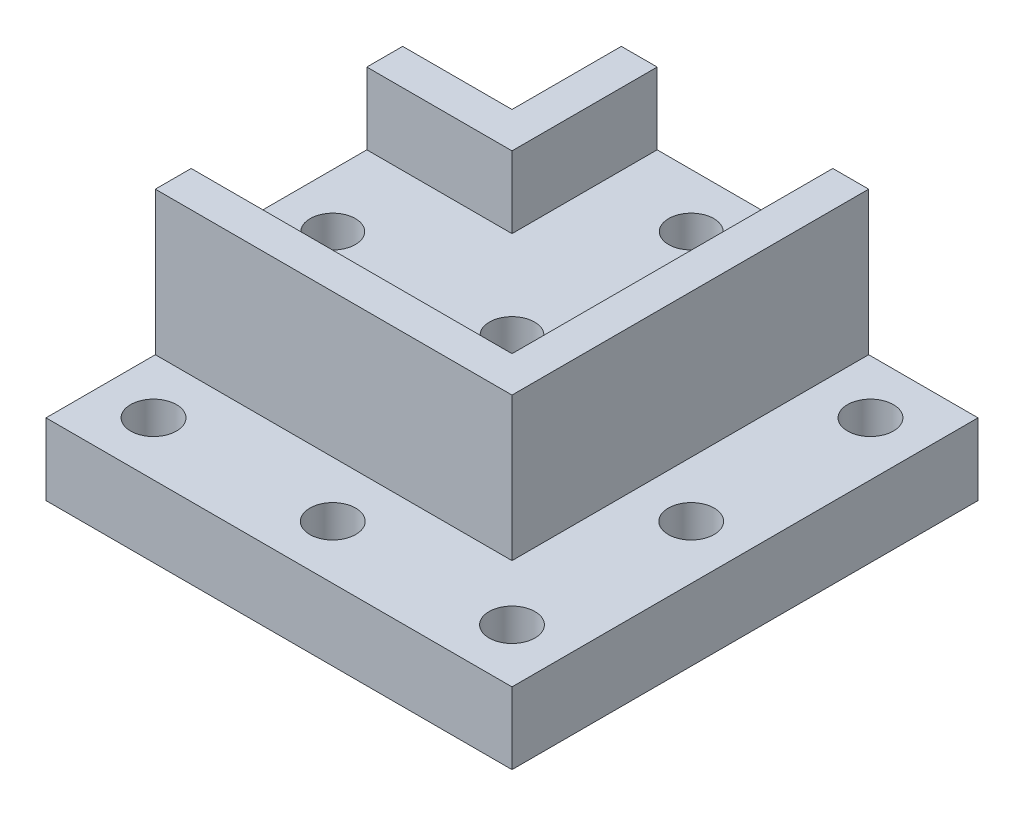
ISO-10303-21;
HEADER;
FILE_DESCRIPTION(('STEP AP214'),'2;1');
FILE_NAME('part.step','',(''),(''),'','','');
FILE_SCHEMA(('AUTOMOTIVE_DESIGN { 1 0 10303 214 1 1 1 1 }'));
ENDSEC;
DATA;
#1=APPLICATION_CONTEXT('core data for automotive mechanical design processes');
#2=APPLICATION_PROTOCOL_DEFINITION('international standard','automotive_design',2000,#1);
#3=PRODUCT_CONTEXT('',#1,'mechanical');
#4=PRODUCT('Part','Part','',(#3));
#5=PRODUCT_RELATED_PRODUCT_CATEGORY('part','',(#4));
#6=PRODUCT_DEFINITION_FORMATION('','',#4);
#7=PRODUCT_DEFINITION_CONTEXT('part definition',#1,'design');
#8=PRODUCT_DEFINITION('design','',#6,#7);
#9=PRODUCT_DEFINITION_SHAPE('','',#8);
#10=(LENGTH_UNIT() NAMED_UNIT(*) SI_UNIT(.MILLI.,.METRE.));
#11=(NAMED_UNIT(*) PLANE_ANGLE_UNIT() SI_UNIT($,.RADIAN.));
#12=(NAMED_UNIT(*) SI_UNIT($,.STERADIAN.) SOLID_ANGLE_UNIT());
#13=UNCERTAINTY_MEASURE_WITH_UNIT(LENGTH_MEASURE(1.E-05),#10,'distance_accuracy_value','');
#14=(GEOMETRIC_REPRESENTATION_CONTEXT(3) GLOBAL_UNCERTAINTY_ASSIGNED_CONTEXT((#13)) GLOBAL_UNIT_ASSIGNED_CONTEXT((#10,
#11,#12)) REPRESENTATION_CONTEXT('',''));
#15=CARTESIAN_POINT('',(0.,0.,0.));
#16=DIRECTION('',(0.,0.,1.));
#17=DIRECTION('',(1.,0.,0.));
#18=AXIS2_PLACEMENT_3D('',#15,#16,#17);
#19=CARTESIAN_POINT('',(0.,10.,0.));
#20=DIRECTION('',(0.,1.,0.));
#21=DIRECTION('',(0.,0.,1.));
#22=AXIS2_PLACEMENT_3D('',#19,#20,#21);
#23=PLANE('',#22);
#24=CARTESIAN_POINT('',(25.,10.,25.));
#25=DIRECTION('',(0.,1.,0.));
#26=DIRECTION('',(0.,0.,1.));
#27=AXIS2_PLACEMENT_3D('',#24,#25,#26);
#28=CIRCLE('',#27,3.2);
#29=CARTESIAN_POINT('',(25.,10.,28.2));
#30=VERTEX_POINT('',#29);
#31=EDGE_CURVE('E274',#30,#30,#28,.T.);
#32=ORIENTED_EDGE('',*,*,#31,.F.);
#33=EDGE_LOOP('',(#32));
#34=FACE_BOUND('',#33,.T.);
#35=CARTESIAN_POINT('',(25.,10.,-25.));
#36=DIRECTION('',(0.,1.,0.));
#37=DIRECTION('',(0.,0.,1.));
#38=AXIS2_PLACEMENT_3D('',#35,#36,#37);
#39=CIRCLE('',#38,3.2);
#40=CARTESIAN_POINT('',(25.,10.,-21.8));
#41=VERTEX_POINT('',#40);
#42=EDGE_CURVE('E286',#41,#41,#39,.T.);
#43=ORIENTED_EDGE('',*,*,#42,.F.);
#44=EDGE_LOOP('',(#43));
#45=FACE_BOUND('',#44,.T.);
#46=CARTESIAN_POINT('',(25.,10.,0.));
#47=DIRECTION('',(0.,1.,0.));
#48=DIRECTION('',(0.,0.,1.));
#49=AXIS2_PLACEMENT_3D('',#46,#47,#48);
#50=CIRCLE('',#49,3.2);
#51=CARTESIAN_POINT('',(25.,10.,3.2));
#52=VERTEX_POINT('',#51);
#53=EDGE_CURVE('E298',#52,#52,#50,.T.);
#54=ORIENTED_EDGE('',*,*,#53,.F.);
#55=EDGE_LOOP('',(#54));
#56=FACE_BOUND('',#55,.T.);
#57=CARTESIAN_POINT('',(0.,10.,25.));
#58=DIRECTION('',(0.,1.,0.));
#59=DIRECTION('',(0.,0.,1.));
#60=AXIS2_PLACEMENT_3D('',#57,#58,#59);
#61=CIRCLE('',#60,3.2);
#62=CARTESIAN_POINT('',(0.,10.,28.2));
#63=VERTEX_POINT('',#62);
#64=EDGE_CURVE('E292',#63,#63,#61,.T.);
#65=ORIENTED_EDGE('',*,*,#64,.F.);
#66=EDGE_LOOP('',(#65));
#67=FACE_BOUND('',#66,.T.);
#68=CARTESIAN_POINT('',(-25.,10.,25.));
#69=DIRECTION('',(0.,1.,0.));
#70=DIRECTION('',(0.,0.,1.));
#71=AXIS2_PLACEMENT_3D('',#68,#69,#70);
#72=CIRCLE('',#71,3.2);
#73=CARTESIAN_POINT('',(-25.,10.,28.2));
#74=VERTEX_POINT('',#73);
#75=EDGE_CURVE('E268',#74,#74,#72,.T.);
#76=ORIENTED_EDGE('',*,*,#75,.F.);
#77=EDGE_LOOP('',(#76));
#78=FACE_BOUND('',#77,.T.);
#79=DIRECTION('',(0.,0.,-1.));
#80=VECTOR('',#79,1.);
#81=CARTESIAN_POINT('',(17.25,10.,-32.5));
#82=LINE('',#81,#80);
#83=CARTESIAN_POINT('',(17.25,10.,17.25));
#84=VERTEX_POINT('',#83);
#85=CARTESIAN_POINT('',(17.25,10.,-32.5));
#86=VERTEX_POINT('',#85);
#87=EDGE_CURVE('E179',#84,#86,#82,.T.);
#88=ORIENTED_EDGE('',*,*,#87,.F.);
#89=DIRECTION('',(1.,0.,0.));
#90=VECTOR('',#89,1.);
#91=CARTESIAN_POINT('',(17.25,10.,17.25));
#92=LINE('',#91,#90);
#93=CARTESIAN_POINT('',(-32.5,10.,17.25));
#94=VERTEX_POINT('',#93);
#95=EDGE_CURVE('E446',#94,#84,#92,.T.);
#96=ORIENTED_EDGE('',*,*,#95,.F.);
#97=DIRECTION('',(0.,0.,1.));
#98=VECTOR('',#97,1.);
#99=CARTESIAN_POINT('',(-32.5,10.,-32.5));
#100=LINE('',#99,#98);
#101=CARTESIAN_POINT('',(-32.5,10.,32.5));
#102=VERTEX_POINT('',#101);
#103=EDGE_CURVE('E85',#94,#102,#100,.T.);
#104=ORIENTED_EDGE('',*,*,#103,.T.);
#105=DIRECTION('',(1.,0.,0.));
#106=VECTOR('',#105,1.);
#107=CARTESIAN_POINT('',(-32.5,10.,32.5));
#108=LINE('',#107,#106);
#109=CARTESIAN_POINT('',(32.5,10.,32.5));
#110=VERTEX_POINT('',#109);
#111=EDGE_CURVE('E306',#102,#110,#108,.T.);
#112=ORIENTED_EDGE('',*,*,#111,.T.);
#113=DIRECTION('',(0.,0.,-1.));
#114=VECTOR('',#113,1.);
#115=CARTESIAN_POINT('',(32.5,10.,-32.5));
#116=LINE('',#115,#114);
#117=CARTESIAN_POINT('',(32.5,10.,-32.5));
#118=VERTEX_POINT('',#117);
#119=EDGE_CURVE('E308',#110,#118,#116,.T.);
#120=ORIENTED_EDGE('',*,*,#119,.T.);
#121=DIRECTION('',(-1.,0.,0.));
#122=VECTOR('',#121,1.);
#123=CARTESIAN_POINT('',(-32.5,10.,-32.5));
#124=LINE('',#123,#122);
#125=EDGE_CURVE('E310',#118,#86,#124,.T.);
#126=ORIENTED_EDGE('',*,*,#125,.T.);
#127=EDGE_LOOP('',(#88,#96,#104,#112,#120,#126));
#128=FACE_BOUND('',#127,.T.);
#129=ADVANCED_FACE('F33',(#34,#45,#56,#67,#78,#128),#23,.T.);
#130=CARTESIAN_POINT('',(-25.,10.,-25.));
#131=DIRECTION('',(0.,1.,0.));
#132=DIRECTION('',(0.,0.,1.));
#133=AXIS2_PLACEMENT_3D('',#130,#131,#132);
#134=CIRCLE('',#133,3.2);
#135=CARTESIAN_POINT('',(-25.,10.,-21.8));
#136=VERTEX_POINT('',#135);
#137=EDGE_CURVE('E280',#136,#136,#134,.T.);
#138=ORIENTED_EDGE('',*,*,#137,.F.);
#139=EDGE_LOOP('',(#138));
#140=FACE_BOUND('',#139,.T.);
#141=DIRECTION('',(-1.,0.,0.));
#142=VECTOR('',#141,1.);
#143=CARTESIAN_POINT('',(-17.25,10.,-17.25));
#144=LINE('',#143,#142);
#145=CARTESIAN_POINT('',(-17.25,10.,-17.25));
#146=VERTEX_POINT('',#145);
#147=CARTESIAN_POINT('',(-32.5,10.,-17.25));
#148=VERTEX_POINT('',#147);
#149=EDGE_CURVE('E187',#146,#148,#144,.T.);
#150=ORIENTED_EDGE('',*,*,#149,.F.);
#151=DIRECTION('',(0.,0.,1.));
#152=VECTOR('',#151,1.);
#153=CARTESIAN_POINT('',(-17.25,10.,-32.5));
#154=LINE('',#153,#152);
#155=CARTESIAN_POINT('',(-17.25,10.,-32.5));
#156=VERTEX_POINT('',#155);
#157=EDGE_CURVE('E185',#156,#146,#154,.T.);
#158=ORIENTED_EDGE('',*,*,#157,.F.);
#159=CARTESIAN_POINT('',(-32.5,10.,-32.5));
#160=VERTEX_POINT('',#159);
#161=EDGE_CURVE('E52',#156,#160,#124,.T.);
#162=ORIENTED_EDGE('',*,*,#161,.T.);
#163=EDGE_CURVE('E304',#160,#148,#100,.T.);
#164=ORIENTED_EDGE('',*,*,#163,.T.);
#165=EDGE_LOOP('',(#150,#158,#162,#164));
#166=FACE_BOUND('',#165,.T.);
#167=ADVANCED_FACE('F351',(#140,#166),#23,.T.);
#168=CARTESIAN_POINT('',(0.,0.,0.));
#169=DIRECTION('',(0.,1.,0.));
#170=DIRECTION('',(0.,0.,1.));
#171=AXIS2_PLACEMENT_3D('',#168,#169,#170);
#172=PLANE('',#171);
#173=CARTESIAN_POINT('',(-25.,0.,0.));
#174=DIRECTION('',(0.,-1.,0.));
#175=DIRECTION('',(0.,0.,-1.));
#176=AXIS2_PLACEMENT_3D('',#173,#174,#175);
#177=CIRCLE('',#176,5.25);
#178=CARTESIAN_POINT('',(-25.,0.,-5.25));
#179=VERTEX_POINT('',#178);
#180=EDGE_CURVE('E238',#179,#179,#177,.T.);
#181=ORIENTED_EDGE('',*,*,#180,.F.);
#182=EDGE_LOOP('',(#181));
#183=FACE_BOUND('',#182,.T.);
#184=CARTESIAN_POINT('',(0.,0.,-25.));
#185=DIRECTION('',(0.,-1.,0.));
#186=DIRECTION('',(0.,0.,-1.));
#187=AXIS2_PLACEMENT_3D('',#184,#185,#186);
#188=CIRCLE('',#187,5.25);
#189=CARTESIAN_POINT('',(0.,0.,-30.25));
#190=VERTEX_POINT('',#189);
#191=EDGE_CURVE('E244',#190,#190,#188,.T.);
#192=ORIENTED_EDGE('',*,*,#191,.F.);
#193=EDGE_LOOP('',(#192));
#194=FACE_BOUND('',#193,.T.);
#195=CARTESIAN_POINT('',(0.,0.,0.));
#196=DIRECTION('',(0.,-1.,0.));
#197=DIRECTION('',(0.,0.,-1.));
#198=AXIS2_PLACEMENT_3D('',#195,#196,#197);
#199=CIRCLE('',#198,5.25);
#200=CARTESIAN_POINT('',(0.,0.,-5.25));
#201=VERTEX_POINT('',#200);
#202=EDGE_CURVE('E237',#201,#201,#199,.T.);
#203=ORIENTED_EDGE('',*,*,#202,.F.);
#204=EDGE_LOOP('',(#203));
#205=FACE_BOUND('',#204,.T.);
#206=DIRECTION('',(0.,0.,1.));
#207=VECTOR('',#206,1.);
#208=CARTESIAN_POINT('',(-32.5,0.,-32.5));
#209=LINE('',#208,#207);
#210=CARTESIAN_POINT('',(-32.5,0.,-32.5));
#211=VERTEX_POINT('',#210);
#212=CARTESIAN_POINT('',(-32.5,0.,32.5));
#213=VERTEX_POINT('',#212);
#214=EDGE_CURVE('E301',#211,#213,#209,.T.);
#215=ORIENTED_EDGE('',*,*,#214,.F.);
#216=DIRECTION('',(-1.,0.,0.));
#217=VECTOR('',#216,1.);
#218=CARTESIAN_POINT('',(-32.5,0.,-32.5));
#219=LINE('',#218,#217);
#220=CARTESIAN_POINT('',(32.5,0.,-32.5));
#221=VERTEX_POINT('',#220);
#222=EDGE_CURVE('E77',#221,#211,#219,.T.);
#223=ORIENTED_EDGE('',*,*,#222,.F.);
#224=DIRECTION('',(0.,0.,-1.));
#225=VECTOR('',#224,1.);
#226=CARTESIAN_POINT('',(32.5,0.,-32.5));
#227=LINE('',#226,#225);
#228=CARTESIAN_POINT('',(32.5,0.,32.5));
#229=VERTEX_POINT('',#228);
#230=EDGE_CURVE('E71',#229,#221,#227,.T.);
#231=ORIENTED_EDGE('',*,*,#230,.F.);
#232=DIRECTION('',(1.,0.,0.));
#233=VECTOR('',#232,1.);
#234=CARTESIAN_POINT('',(-32.5,0.,32.5));
#235=LINE('',#234,#233);
#236=EDGE_CURVE('E316',#213,#229,#235,.T.);
#237=ORIENTED_EDGE('',*,*,#236,.F.);
#238=EDGE_LOOP('',(#215,#223,#231,#237));
#239=FACE_BOUND('',#238,.T.);
#240=CARTESIAN_POINT('',(25.,0.,0.));
#241=DIRECTION('',(0.,1.,0.));
#242=DIRECTION('',(0.,0.,1.));
#243=AXIS2_PLACEMENT_3D('',#240,#241,#242);
#244=CIRCLE('',#243,3.2);
#245=CARTESIAN_POINT('',(25.,0.,3.2));
#246=VERTEX_POINT('',#245);
#247=EDGE_CURVE('E295',#246,#246,#244,.T.);
#248=ORIENTED_EDGE('',*,*,#247,.T.);
#249=EDGE_LOOP('',(#248));
#250=FACE_BOUND('',#249,.T.);
#251=CARTESIAN_POINT('',(0.,0.,25.));
#252=DIRECTION('',(0.,1.,0.));
#253=DIRECTION('',(0.,0.,1.));
#254=AXIS2_PLACEMENT_3D('',#251,#252,#253);
#255=CIRCLE('',#254,3.2);
#256=CARTESIAN_POINT('',(0.,0.,28.2));
#257=VERTEX_POINT('',#256);
#258=EDGE_CURVE('E289',#257,#257,#255,.T.);
#259=ORIENTED_EDGE('',*,*,#258,.T.);
#260=EDGE_LOOP('',(#259));
#261=FACE_BOUND('',#260,.T.);
#262=CARTESIAN_POINT('',(25.,0.,-25.));
#263=DIRECTION('',(0.,1.,0.));
#264=DIRECTION('',(0.,0.,1.));
#265=AXIS2_PLACEMENT_3D('',#262,#263,#264);
#266=CIRCLE('',#265,3.2);
#267=CARTESIAN_POINT('',(25.,0.,-21.8));
#268=VERTEX_POINT('',#267);
#269=EDGE_CURVE('E283',#268,#268,#266,.T.);
#270=ORIENTED_EDGE('',*,*,#269,.T.);
#271=EDGE_LOOP('',(#270));
#272=FACE_BOUND('',#271,.T.);
#273=CARTESIAN_POINT('',(-25.,0.,-25.));
#274=DIRECTION('',(0.,1.,0.));
#275=DIRECTION('',(0.,0.,1.));
#276=AXIS2_PLACEMENT_3D('',#273,#274,#275);
#277=CIRCLE('',#276,3.2);
#278=CARTESIAN_POINT('',(-25.,0.,-21.8));
#279=VERTEX_POINT('',#278);
#280=EDGE_CURVE('E277',#279,#279,#277,.T.);
#281=ORIENTED_EDGE('',*,*,#280,.T.);
#282=EDGE_LOOP('',(#281));
#283=FACE_BOUND('',#282,.T.);
#284=CARTESIAN_POINT('',(25.,0.,25.));
#285=DIRECTION('',(0.,1.,0.));
#286=DIRECTION('',(0.,0.,1.));
#287=AXIS2_PLACEMENT_3D('',#284,#285,#286);
#288=CIRCLE('',#287,3.2);
#289=CARTESIAN_POINT('',(25.,0.,28.2));
#290=VERTEX_POINT('',#289);
#291=EDGE_CURVE('E271',#290,#290,#288,.T.);
#292=ORIENTED_EDGE('',*,*,#291,.T.);
#293=EDGE_LOOP('',(#292));
#294=FACE_BOUND('',#293,.T.);
#295=CARTESIAN_POINT('',(-25.,0.,25.));
#296=DIRECTION('',(0.,1.,0.));
#297=DIRECTION('',(0.,0.,1.));
#298=AXIS2_PLACEMENT_3D('',#295,#296,#297);
#299=CIRCLE('',#298,3.2);
#300=CARTESIAN_POINT('',(-25.,0.,28.2));
#301=VERTEX_POINT('',#300);
#302=EDGE_CURVE('E267',#301,#301,#299,.T.);
#303=ORIENTED_EDGE('',*,*,#302,.T.);
#304=EDGE_LOOP('',(#303));
#305=FACE_BOUND('',#304,.T.);
#306=ADVANCED_FACE('F348',(#183,#194,#205,#239,#250,#261,#272,#283,#294,#305),#172,.F.);
#307=CARTESIAN_POINT('',(-32.5,10.,-32.5));
#308=DIRECTION('',(1.,0.,0.));
#309=DIRECTION('',(0.,0.,-1.));
#310=AXIS2_PLACEMENT_3D('',#307,#308,#309);
#311=PLANE('',#310);
#312=ORIENTED_EDGE('',*,*,#103,.F.);
#313=DIRECTION('',(0.,-1.,0.));
#314=VECTOR('',#313,1.);
#315=CARTESIAN_POINT('',(-32.5,30.,17.25));
#316=LINE('',#315,#314);
#317=CARTESIAN_POINT('',(-32.5,30.,17.25));
#318=VERTEX_POINT('',#317);
#319=EDGE_CURVE('E189',#318,#94,#316,.T.);
#320=ORIENTED_EDGE('',*,*,#319,.F.);
#321=DIRECTION('',(0.,0.,1.));
#322=VECTOR('',#321,1.);
#323=CARTESIAN_POINT('',(-32.5,30.,17.25));
#324=LINE('',#323,#322);
#325=CARTESIAN_POINT('',(-32.5,30.,12.25));
#326=VERTEX_POINT('',#325);
#327=EDGE_CURVE('E170',#326,#318,#324,.T.);
#328=ORIENTED_EDGE('',*,*,#327,.F.);
#329=DIRECTION('',(0.,-1.,0.));
#330=VECTOR('',#329,1.);
#331=CARTESIAN_POINT('',(-32.5,30.,12.25));
#332=LINE('',#331,#330);
#333=CARTESIAN_POINT('',(-32.5,20.,12.25));
#334=VERTEX_POINT('',#333);
#335=EDGE_CURVE('E167',#326,#334,#332,.T.);
#336=ORIENTED_EDGE('',*,*,#335,.T.);
#337=DIRECTION('',(0.,0.,1.));
#338=VECTOR('',#337,1.);
#339=CARTESIAN_POINT('',(-32.5,20.,12.25));
#340=LINE('',#339,#338);
#341=CARTESIAN_POINT('',(-32.5,20.,-12.25));
#342=VERTEX_POINT('',#341);
#343=EDGE_CURVE('E255',#342,#334,#340,.T.);
#344=ORIENTED_EDGE('',*,*,#343,.F.);
#345=DIRECTION('',(0.,-1.,0.));
#346=VECTOR('',#345,1.);
#347=CARTESIAN_POINT('',(-32.5,30.,-12.25));
#348=LINE('',#347,#346);
#349=CARTESIAN_POINT('',(-32.5,30.,-12.25));
#350=VERTEX_POINT('',#349);
#351=EDGE_CURVE('E210',#350,#342,#348,.T.);
#352=ORIENTED_EDGE('',*,*,#351,.F.);
#353=DIRECTION('',(0.,0.,1.));
#354=VECTOR('',#353,1.);
#355=CARTESIAN_POINT('',(-32.5,30.,-17.25));
#356=LINE('',#355,#354);
#357=CARTESIAN_POINT('',(-32.5,30.,-17.25));
#358=VERTEX_POINT('',#357);
#359=EDGE_CURVE('E202',#358,#350,#356,.T.);
#360=ORIENTED_EDGE('',*,*,#359,.F.);
#361=DIRECTION('',(0.,-1.,0.));
#362=VECTOR('',#361,1.);
#363=CARTESIAN_POINT('',(-32.5,30.,-17.25));
#364=LINE('',#363,#362);
#365=EDGE_CURVE('E212',#358,#148,#364,.T.);
#366=ORIENTED_EDGE('',*,*,#365,.T.);
#367=ORIENTED_EDGE('',*,*,#163,.F.);
#368=DIRECTION('',(0.,-1.,0.));
#369=VECTOR('',#368,1.);
#370=CARTESIAN_POINT('',(-32.5,10.,-32.5));
#371=LINE('',#370,#369);
#372=EDGE_CURVE('E313',#160,#211,#371,.T.);
#373=ORIENTED_EDGE('',*,*,#372,.T.);
#374=ORIENTED_EDGE('',*,*,#214,.T.);
#375=DIRECTION('',(0.,-1.,0.));
#376=VECTOR('',#375,1.);
#377=CARTESIAN_POINT('',(-32.5,10.,32.5));
#378=LINE('',#377,#376);
#379=EDGE_CURVE('E11',#102,#213,#378,.T.);
#380=ORIENTED_EDGE('',*,*,#379,.F.);
#381=EDGE_LOOP('',(#312,#320,#328,#336,#344,#352,#360,#366,#367,#373,#374,#380));
#382=FACE_BOUND('',#381,.T.);
#383=ADVANCED_FACE('F35',(#382),#311,.F.);
#384=CARTESIAN_POINT('',(-32.5,10.,32.5));
#385=DIRECTION('',(0.,0.,-1.));
#386=DIRECTION('',(-1.,0.,0.));
#387=AXIS2_PLACEMENT_3D('',#384,#385,#386);
#388=PLANE('',#387);
#389=ORIENTED_EDGE('',*,*,#236,.T.);
#390=DIRECTION('',(0.,-1.,0.));
#391=VECTOR('',#390,1.);
#392=CARTESIAN_POINT('',(32.5,10.,32.5));
#393=LINE('',#392,#391);
#394=EDGE_CURVE('E43',#110,#229,#393,.T.);
#395=ORIENTED_EDGE('',*,*,#394,.F.);
#396=ORIENTED_EDGE('',*,*,#111,.F.);
#397=ORIENTED_EDGE('',*,*,#379,.T.);
#398=EDGE_LOOP('',(#389,#395,#396,#397));
#399=FACE_BOUND('',#398,.T.);
#400=ADVANCED_FACE('F404',(#399),#388,.F.);
#401=CARTESIAN_POINT('',(32.5,10.,-32.5));
#402=DIRECTION('',(-1.,0.,0.));
#403=DIRECTION('',(0.,0.,1.));
#404=AXIS2_PLACEMENT_3D('',#401,#402,#403);
#405=PLANE('',#404);
#406=ORIENTED_EDGE('',*,*,#230,.T.);
#407=DIRECTION('',(0.,-1.,0.));
#408=VECTOR('',#407,1.);
#409=CARTESIAN_POINT('',(32.5,10.,-32.5));
#410=LINE('',#409,#408);
#411=EDGE_CURVE('E321',#118,#221,#410,.T.);
#412=ORIENTED_EDGE('',*,*,#411,.F.);
#413=ORIENTED_EDGE('',*,*,#119,.F.);
#414=ORIENTED_EDGE('',*,*,#394,.T.);
#415=EDGE_LOOP('',(#406,#412,#413,#414));
#416=FACE_BOUND('',#415,.T.);
#417=ADVANCED_FACE('F402',(#416),#405,.F.);
#418=CARTESIAN_POINT('',(-32.5,10.,-32.5));
#419=DIRECTION('',(0.,0.,1.));
#420=DIRECTION('',(1.,0.,0.));
#421=AXIS2_PLACEMENT_3D('',#418,#419,#420);
#422=PLANE('',#421);
#423=ORIENTED_EDGE('',*,*,#161,.F.);
#424=DIRECTION('',(0.,-1.,0.));
#425=VECTOR('',#424,1.);
#426=CARTESIAN_POINT('',(-17.25,30.,-32.5));
#427=LINE('',#426,#425);
#428=CARTESIAN_POINT('',(-17.25,30.,-32.5));
#429=VERTEX_POINT('',#428);
#430=EDGE_CURVE('E218',#429,#156,#427,.T.);
#431=ORIENTED_EDGE('',*,*,#430,.F.);
#432=DIRECTION('',(-1.,0.,0.));
#433=VECTOR('',#432,1.);
#434=CARTESIAN_POINT('',(-12.25,30.,-32.5));
#435=LINE('',#434,#433);
#436=CARTESIAN_POINT('',(-12.25,30.,-32.5));
#437=VERTEX_POINT('',#436);
#438=EDGE_CURVE('E196',#437,#429,#435,.T.);
#439=ORIENTED_EDGE('',*,*,#438,.F.);
#440=DIRECTION('',(0.,-1.,0.));
#441=VECTOR('',#440,1.);
#442=CARTESIAN_POINT('',(-12.25,30.,-32.5));
#443=LINE('',#442,#441);
#444=CARTESIAN_POINT('',(-12.25,20.,-32.5));
#445=VERTEX_POINT('',#444);
#446=EDGE_CURVE('E220',#437,#445,#443,.T.);
#447=ORIENTED_EDGE('',*,*,#446,.T.);
#448=DIRECTION('',(-1.,0.,0.));
#449=VECTOR('',#448,1.);
#450=CARTESIAN_POINT('',(12.25,20.,-32.5));
#451=LINE('',#450,#449);
#452=CARTESIAN_POINT('',(12.25,20.,-32.5));
#453=VERTEX_POINT('',#452);
#454=EDGE_CURVE('E261',#453,#445,#451,.T.);
#455=ORIENTED_EDGE('',*,*,#454,.F.);
#456=DIRECTION('',(0.,-1.,0.));
#457=VECTOR('',#456,1.);
#458=CARTESIAN_POINT('',(12.25,30.,-32.5));
#459=LINE('',#458,#457);
#460=CARTESIAN_POINT('',(12.25,30.,-32.5));
#461=VERTEX_POINT('',#460);
#462=EDGE_CURVE('E445',#461,#453,#459,.T.);
#463=ORIENTED_EDGE('',*,*,#462,.F.);
#464=DIRECTION('',(-1.,0.,0.));
#465=VECTOR('',#464,1.);
#466=CARTESIAN_POINT('',(12.25,30.,-32.5));
#467=LINE('',#466,#465);
#468=CARTESIAN_POINT('',(17.25,30.,-32.5));
#469=VERTEX_POINT('',#468);
#470=EDGE_CURVE('E176',#469,#461,#467,.T.);
#471=ORIENTED_EDGE('',*,*,#470,.F.);
#472=DIRECTION('',(0.,-1.,0.));
#473=VECTOR('',#472,1.);
#474=CARTESIAN_POINT('',(17.25,30.,-32.5));
#475=LINE('',#474,#473);
#476=EDGE_CURVE('E450',#469,#86,#475,.T.);
#477=ORIENTED_EDGE('',*,*,#476,.T.);
#478=ORIENTED_EDGE('',*,*,#125,.F.);
#479=ORIENTED_EDGE('',*,*,#411,.T.);
#480=ORIENTED_EDGE('',*,*,#222,.T.);
#481=ORIENTED_EDGE('',*,*,#372,.F.);
#482=EDGE_LOOP('',(#423,#431,#439,#447,#455,#463,#471,#477,#478,#479,#480,#481));
#483=FACE_BOUND('',#482,.T.);
#484=ADVANCED_FACE('F399',(#483),#422,.F.);
#485=CARTESIAN_POINT('',(25.,10.,0.));
#486=DIRECTION('',(0.,-1.,0.));
#487=DIRECTION('',(0.,0.,-1.));
#488=AXIS2_PLACEMENT_3D('',#485,#486,#487);
#489=CYLINDRICAL_SURFACE('',#488,3.2);
#490=ORIENTED_EDGE('',*,*,#53,.T.);
#491=EDGE_LOOP('',(#490));
#492=FACE_BOUND('',#491,.T.);
#493=ORIENTED_EDGE('',*,*,#247,.F.);
#494=EDGE_LOOP('',(#493));
#495=FACE_BOUND('',#494,.T.);
#496=ADVANCED_FACE('F396',(#492,#495),#489,.F.);
#497=CARTESIAN_POINT('',(0.,10.,25.));
#498=DIRECTION('',(0.,-1.,0.));
#499=DIRECTION('',(0.,0.,-1.));
#500=AXIS2_PLACEMENT_3D('',#497,#498,#499);
#501=CYLINDRICAL_SURFACE('',#500,3.2);
#502=ORIENTED_EDGE('',*,*,#64,.T.);
#503=EDGE_LOOP('',(#502));
#504=FACE_BOUND('',#503,.T.);
#505=ORIENTED_EDGE('',*,*,#258,.F.);
#506=EDGE_LOOP('',(#505));
#507=FACE_BOUND('',#506,.T.);
#508=ADVANCED_FACE('F695',(#504,#507),#501,.F.);
#509=CARTESIAN_POINT('',(25.,10.,-25.));
#510=DIRECTION('',(0.,-1.,0.));
#511=DIRECTION('',(0.,0.,-1.));
#512=AXIS2_PLACEMENT_3D('',#509,#510,#511);
#513=CYLINDRICAL_SURFACE('',#512,3.2);
#514=ORIENTED_EDGE('',*,*,#42,.T.);
#515=EDGE_LOOP('',(#514));
#516=FACE_BOUND('',#515,.T.);
#517=ORIENTED_EDGE('',*,*,#269,.F.);
#518=EDGE_LOOP('',(#517));
#519=FACE_BOUND('',#518,.T.);
#520=ADVANCED_FACE('F686',(#516,#519),#513,.F.);
#521=CARTESIAN_POINT('',(-25.,10.,-25.));
#522=DIRECTION('',(0.,-1.,0.));
#523=DIRECTION('',(0.,0.,-1.));
#524=AXIS2_PLACEMENT_3D('',#521,#522,#523);
#525=CYLINDRICAL_SURFACE('',#524,3.2);
#526=ORIENTED_EDGE('',*,*,#137,.T.);
#527=EDGE_LOOP('',(#526));
#528=FACE_BOUND('',#527,.T.);
#529=ORIENTED_EDGE('',*,*,#280,.F.);
#530=EDGE_LOOP('',(#529));
#531=FACE_BOUND('',#530,.T.);
#532=ADVANCED_FACE('F383',(#528,#531),#525,.F.);
#533=CARTESIAN_POINT('',(25.,10.,25.));
#534=DIRECTION('',(0.,-1.,0.));
#535=DIRECTION('',(0.,0.,-1.));
#536=AXIS2_PLACEMENT_3D('',#533,#534,#535);
#537=CYLINDRICAL_SURFACE('',#536,3.2);
#538=ORIENTED_EDGE('',*,*,#31,.T.);
#539=EDGE_LOOP('',(#538));
#540=FACE_BOUND('',#539,.T.);
#541=ORIENTED_EDGE('',*,*,#291,.F.);
#542=EDGE_LOOP('',(#541));
#543=FACE_BOUND('',#542,.T.);
#544=ADVANCED_FACE('F373',(#540,#543),#537,.F.);
#545=CARTESIAN_POINT('',(-25.,10.,25.));
#546=DIRECTION('',(0.,-1.,0.));
#547=DIRECTION('',(0.,0.,-1.));
#548=AXIS2_PLACEMENT_3D('',#545,#546,#547);
#549=CYLINDRICAL_SURFACE('',#548,3.2);
#550=ORIENTED_EDGE('',*,*,#75,.T.);
#551=EDGE_LOOP('',(#550));
#552=FACE_BOUND('',#551,.T.);
#553=ORIENTED_EDGE('',*,*,#302,.F.);
#554=EDGE_LOOP('',(#553));
#555=FACE_BOUND('',#554,.T.);
#556=ADVANCED_FACE('F370',(#552,#555),#549,.F.);
#557=CARTESIAN_POINT('',(0.,20.,0.));
#558=DIRECTION('',(0.,-1.,0.));
#559=DIRECTION('',(0.,0.,-1.));
#560=AXIS2_PLACEMENT_3D('',#557,#558,#559);
#561=PLANE('',#560);
#562=CARTESIAN_POINT('',(0.,20.,-25.));
#563=DIRECTION('',(0.,-1.,0.));
#564=DIRECTION('',(0.,0.,-1.));
#565=AXIS2_PLACEMENT_3D('',#562,#563,#564);
#566=CIRCLE('',#565,3.15);
#567=CARTESIAN_POINT('',(0.,20.,-28.15));
#568=VERTEX_POINT('',#567);
#569=EDGE_CURVE('E224',#568,#568,#566,.F.);
#570=ORIENTED_EDGE('',*,*,#569,.F.);
#571=EDGE_LOOP('',(#570));
#572=FACE_BOUND('',#571,.T.);
#573=CARTESIAN_POINT('',(-25.,20.,0.));
#574=DIRECTION('',(0.,-1.,0.));
#575=DIRECTION('',(0.,0.,-1.));
#576=AXIS2_PLACEMENT_3D('',#573,#574,#575);
#577=CIRCLE('',#576,3.15);
#578=CARTESIAN_POINT('',(-25.,20.,-3.15));
#579=VERTEX_POINT('',#578);
#580=EDGE_CURVE('E223',#579,#579,#577,.F.);
#581=ORIENTED_EDGE('',*,*,#580,.F.);
#582=EDGE_LOOP('',(#581));
#583=FACE_BOUND('',#582,.T.);
#584=CARTESIAN_POINT('',(0.,20.,0.));
#585=DIRECTION('',(0.,-1.,0.));
#586=DIRECTION('',(0.,0.,-1.));
#587=AXIS2_PLACEMENT_3D('',#584,#585,#586);
#588=CIRCLE('',#587,3.15);
#589=CARTESIAN_POINT('',(0.,20.,-3.15));
#590=VERTEX_POINT('',#589);
#591=EDGE_CURVE('E230',#590,#590,#588,.F.);
#592=ORIENTED_EDGE('',*,*,#591,.F.);
#593=EDGE_LOOP('',(#592));
#594=FACE_BOUND('',#593,.T.);
#595=DIRECTION('',(-1.,0.,0.));
#596=VECTOR('',#595,1.);
#597=CARTESIAN_POINT('',(-12.25,20.,-12.25));
#598=LINE('',#597,#596);
#599=CARTESIAN_POINT('',(-12.25,20.,-12.25));
#600=VERTEX_POINT('',#599);
#601=EDGE_CURVE('E250',#600,#342,#598,.T.);
#602=ORIENTED_EDGE('',*,*,#601,.T.);
#603=ORIENTED_EDGE('',*,*,#343,.T.);
#604=DIRECTION('',(1.,0.,0.));
#605=VECTOR('',#604,1.);
#606=CARTESIAN_POINT('',(-32.5,20.,12.25));
#607=LINE('',#606,#605);
#608=CARTESIAN_POINT('',(12.25,20.,12.25));
#609=VERTEX_POINT('',#608);
#610=EDGE_CURVE('E258',#334,#609,#607,.T.);
#611=ORIENTED_EDGE('',*,*,#610,.T.);
#612=DIRECTION('',(0.,0.,-1.));
#613=VECTOR('',#612,1.);
#614=CARTESIAN_POINT('',(12.25,20.,-32.5));
#615=LINE('',#614,#613);
#616=EDGE_CURVE('E183',#609,#453,#615,.T.);
#617=ORIENTED_EDGE('',*,*,#616,.T.);
#618=ORIENTED_EDGE('',*,*,#454,.T.);
#619=DIRECTION('',(0.,0.,1.));
#620=VECTOR('',#619,1.);
#621=CARTESIAN_POINT('',(-12.25,20.,-12.25));
#622=LINE('',#621,#620);
#623=EDGE_CURVE('E264',#445,#600,#622,.T.);
#624=ORIENTED_EDGE('',*,*,#623,.T.);
#625=EDGE_LOOP('',(#602,#603,#611,#617,#618,#624));
#626=FACE_BOUND('',#625,.T.);
#627=ADVANCED_FACE('F372',(#572,#583,#594,#626),#561,.F.);
#628=CARTESIAN_POINT('',(0.,10.,0.));
#629=DIRECTION('',(0.,-1.,0.));
#630=DIRECTION('',(0.,0.,-1.));
#631=AXIS2_PLACEMENT_3D('',#628,#629,#630);
#632=CYLINDRICAL_SURFACE('',#631,5.25);
#633=CARTESIAN_POINT('',(0.,10.,0.));
#634=DIRECTION('',(0.,-1.,0.));
#635=DIRECTION('',(0.,0.,-1.));
#636=AXIS2_PLACEMENT_3D('',#633,#634,#635);
#637=CIRCLE('',#636,5.25);
#638=CARTESIAN_POINT('',(0.,10.,-5.25));
#639=VERTEX_POINT('',#638);
#640=EDGE_CURVE('E247',#639,#639,#637,.T.);
#641=ORIENTED_EDGE('',*,*,#640,.F.);
#642=EDGE_LOOP('',(#641));
#643=FACE_BOUND('',#642,.T.);
#644=ORIENTED_EDGE('',*,*,#202,.T.);
#645=EDGE_LOOP('',(#644));
#646=FACE_BOUND('',#645,.T.);
#647=ADVANCED_FACE('F380',(#643,#646),#632,.F.);
#648=CARTESIAN_POINT('',(0.,10.,0.));
#649=DIRECTION('',(0.,-1.,0.));
#650=DIRECTION('',(0.,0.,-1.));
#651=AXIS2_PLACEMENT_3D('',#648,#649,#650);
#652=PLANE('',#651);
#653=CARTESIAN_POINT('',(0.,10.,0.));
#654=DIRECTION('',(0.,-1.,0.));
#655=DIRECTION('',(0.,0.,-1.));
#656=AXIS2_PLACEMENT_3D('',#653,#654,#655);
#657=CIRCLE('',#656,3.15);
#658=CARTESIAN_POINT('',(0.,10.,-3.15));
#659=VERTEX_POINT('',#658);
#660=EDGE_CURVE('E233',#659,#659,#657,.T.);
#661=ORIENTED_EDGE('',*,*,#660,.F.);
#662=EDGE_LOOP('',(#661));
#663=FACE_BOUND('',#662,.T.);
#664=ORIENTED_EDGE('',*,*,#640,.T.);
#665=EDGE_LOOP('',(#664));
#666=FACE_BOUND('',#665,.T.);
#667=ADVANCED_FACE('F344',(#663,#666),#652,.T.);
#668=CARTESIAN_POINT('',(0.,10.,-25.));
#669=DIRECTION('',(0.,-1.,0.));
#670=DIRECTION('',(0.,0.,-1.));
#671=AXIS2_PLACEMENT_3D('',#668,#669,#670);
#672=CYLINDRICAL_SURFACE('',#671,5.25);
#673=CARTESIAN_POINT('',(0.,10.,-25.));
#674=DIRECTION('',(0.,-1.,0.));
#675=DIRECTION('',(0.,0.,-1.));
#676=AXIS2_PLACEMENT_3D('',#673,#674,#675);
#677=CIRCLE('',#676,5.25);
#678=CARTESIAN_POINT('',(0.,10.,-30.25));
#679=VERTEX_POINT('',#678);
#680=EDGE_CURVE('E241',#679,#679,#677,.T.);
#681=ORIENTED_EDGE('',*,*,#680,.F.);
#682=EDGE_LOOP('',(#681));
#683=FACE_BOUND('',#682,.T.);
#684=ORIENTED_EDGE('',*,*,#191,.T.);
#685=EDGE_LOOP('',(#684));
#686=FACE_BOUND('',#685,.T.);
#687=ADVANCED_FACE('F338',(#683,#686),#672,.F.);
#688=CARTESIAN_POINT('',(0.,10.,-25.));
#689=DIRECTION('',(0.,-1.,0.));
#690=DIRECTION('',(0.,0.,-1.));
#691=AXIS2_PLACEMENT_3D('',#688,#689,#690);
#692=PLANE('',#691);
#693=CARTESIAN_POINT('',(0.,10.,-25.));
#694=DIRECTION('',(0.,-1.,0.));
#695=DIRECTION('',(0.,0.,-1.));
#696=AXIS2_PLACEMENT_3D('',#693,#694,#695);
#697=CIRCLE('',#696,3.15);
#698=CARTESIAN_POINT('',(0.,10.,-28.15));
#699=VERTEX_POINT('',#698);
#700=EDGE_CURVE('E37',#699,#699,#697,.T.);
#701=ORIENTED_EDGE('',*,*,#700,.F.);
#702=EDGE_LOOP('',(#701));
#703=FACE_BOUND('',#702,.T.);
#704=ORIENTED_EDGE('',*,*,#680,.T.);
#705=EDGE_LOOP('',(#704));
#706=FACE_BOUND('',#705,.T.);
#707=ADVANCED_FACE('F334',(#703,#706),#692,.T.);
#708=CARTESIAN_POINT('',(-25.,10.,0.));
#709=DIRECTION('',(0.,-1.,0.));
#710=DIRECTION('',(0.,0.,-1.));
#711=AXIS2_PLACEMENT_3D('',#708,#709,#710);
#712=CYLINDRICAL_SURFACE('',#711,5.25);
#713=CARTESIAN_POINT('',(-25.,10.,0.));
#714=DIRECTION('',(0.,-1.,0.));
#715=DIRECTION('',(0.,0.,-1.));
#716=AXIS2_PLACEMENT_3D('',#713,#714,#715);
#717=CIRCLE('',#716,5.25);
#718=CARTESIAN_POINT('',(-25.,10.,-5.25));
#719=VERTEX_POINT('',#718);
#720=EDGE_CURVE('E234',#719,#719,#717,.T.);
#721=ORIENTED_EDGE('',*,*,#720,.F.);
#722=EDGE_LOOP('',(#721));
#723=FACE_BOUND('',#722,.T.);
#724=ORIENTED_EDGE('',*,*,#180,.T.);
#725=EDGE_LOOP('',(#724));
#726=FACE_BOUND('',#725,.T.);
#727=ADVANCED_FACE('F337',(#723,#726),#712,.F.);
#728=CARTESIAN_POINT('',(-25.,10.,0.));
#729=DIRECTION('',(0.,-1.,0.));
#730=DIRECTION('',(0.,0.,-1.));
#731=AXIS2_PLACEMENT_3D('',#728,#729,#730);
#732=PLANE('',#731);
#733=CARTESIAN_POINT('',(-25.,10.,0.));
#734=DIRECTION('',(0.,-1.,0.));
#735=DIRECTION('',(0.,0.,-1.));
#736=AXIS2_PLACEMENT_3D('',#733,#734,#735);
#737=CIRCLE('',#736,3.15);
#738=CARTESIAN_POINT('',(-25.,10.,-3.15));
#739=VERTEX_POINT('',#738);
#740=EDGE_CURVE('E227',#739,#739,#737,.T.);
#741=ORIENTED_EDGE('',*,*,#740,.F.);
#742=EDGE_LOOP('',(#741));
#743=FACE_BOUND('',#742,.T.);
#744=ORIENTED_EDGE('',*,*,#720,.T.);
#745=EDGE_LOOP('',(#744));
#746=FACE_BOUND('',#745,.T.);
#747=ADVANCED_FACE('F497',(#743,#746),#732,.T.);
#748=CARTESIAN_POINT('',(0.,28.9095454429505,0.));
#749=DIRECTION('',(0.,-1.,0.));
#750=DIRECTION('',(0.,0.,-1.));
#751=AXIS2_PLACEMENT_3D('',#748,#749,#750);
#752=CYLINDRICAL_SURFACE('',#751,3.15);
#753=ORIENTED_EDGE('',*,*,#660,.T.);
#754=EDGE_LOOP('',(#753));
#755=FACE_BOUND('',#754,.T.);
#756=ORIENTED_EDGE('',*,*,#591,.T.);
#757=EDGE_LOOP('',(#756));
#758=FACE_BOUND('',#757,.T.);
#759=ADVANCED_FACE('F494',(#755,#758),#752,.F.);
#760=CARTESIAN_POINT('',(-25.,28.9095454429505,0.));
#761=DIRECTION('',(0.,-1.,0.));
#762=DIRECTION('',(0.,0.,-1.));
#763=AXIS2_PLACEMENT_3D('',#760,#761,#762);
#764=CYLINDRICAL_SURFACE('',#763,3.15);
#765=ORIENTED_EDGE('',*,*,#740,.T.);
#766=EDGE_LOOP('',(#765));
#767=FACE_BOUND('',#766,.T.);
#768=ORIENTED_EDGE('',*,*,#580,.T.);
#769=EDGE_LOOP('',(#768));
#770=FACE_BOUND('',#769,.T.);
#771=ADVANCED_FACE('F491',(#767,#770),#764,.F.);
#772=CARTESIAN_POINT('',(0.,28.9095454429505,-25.));
#773=DIRECTION('',(0.,-1.,0.));
#774=DIRECTION('',(0.,0.,-1.));
#775=AXIS2_PLACEMENT_3D('',#772,#773,#774);
#776=CYLINDRICAL_SURFACE('',#775,3.15);
#777=ORIENTED_EDGE('',*,*,#700,.T.);
#778=EDGE_LOOP('',(#777));
#779=FACE_BOUND('',#778,.T.);
#780=ORIENTED_EDGE('',*,*,#569,.T.);
#781=EDGE_LOOP('',(#780));
#782=FACE_BOUND('',#781,.T.);
#783=ADVANCED_FACE('F331',(#779,#782),#776,.F.);
#784=CARTESIAN_POINT('',(-12.25,30.,-12.25));
#785=DIRECTION('',(-1.,0.,0.));
#786=DIRECTION('',(0.,0.,1.));
#787=AXIS2_PLACEMENT_3D('',#784,#785,#786);
#788=PLANE('',#787);
#789=DIRECTION('',(0.,-1.,0.));
#790=VECTOR('',#789,1.);
#791=CARTESIAN_POINT('',(-12.25,30.,-12.25));
#792=LINE('',#791,#790);
#793=CARTESIAN_POINT('',(-12.25,30.,-12.25));
#794=VERTEX_POINT('',#793);
#795=EDGE_CURVE('E205',#794,#600,#792,.T.);
#796=ORIENTED_EDGE('',*,*,#795,.T.);
#797=ORIENTED_EDGE('',*,*,#623,.F.);
#798=ORIENTED_EDGE('',*,*,#446,.F.);
#799=DIRECTION('',(0.,0.,-1.));
#800=VECTOR('',#799,1.);
#801=CARTESIAN_POINT('',(-12.25,30.,-12.25));
#802=LINE('',#801,#800);
#803=EDGE_CURVE('E193',#794,#437,#802,.T.);
#804=ORIENTED_EDGE('',*,*,#803,.F.);
#805=EDGE_LOOP('',(#796,#797,#798,#804));
#806=FACE_BOUND('',#805,.T.);
#807=ADVANCED_FACE('F432',(#806),#788,.F.);
#808=CARTESIAN_POINT('',(-32.5,30.,-12.25));
#809=DIRECTION('',(0.,0.,-1.));
#810=DIRECTION('',(-1.,0.,0.));
#811=AXIS2_PLACEMENT_3D('',#808,#809,#810);
#812=PLANE('',#811);
#813=ORIENTED_EDGE('',*,*,#351,.T.);
#814=ORIENTED_EDGE('',*,*,#601,.F.);
#815=ORIENTED_EDGE('',*,*,#795,.F.);
#816=DIRECTION('',(1.,0.,0.));
#817=VECTOR('',#816,1.);
#818=CARTESIAN_POINT('',(-32.5,30.,-12.25));
#819=LINE('',#818,#817);
#820=EDGE_CURVE('E204',#350,#794,#819,.T.);
#821=ORIENTED_EDGE('',*,*,#820,.F.);
#822=EDGE_LOOP('',(#813,#814,#815,#821));
#823=FACE_BOUND('',#822,.T.);
#824=ADVANCED_FACE('F478',(#823),#812,.F.);
#825=CARTESIAN_POINT('',(-17.25,30.,-32.5));
#826=DIRECTION('',(1.,0.,0.));
#827=DIRECTION('',(0.,0.,-1.));
#828=AXIS2_PLACEMENT_3D('',#825,#826,#827);
#829=PLANE('',#828);
#830=ORIENTED_EDGE('',*,*,#157,.T.);
#831=DIRECTION('',(0.,-1.,0.));
#832=VECTOR('',#831,1.);
#833=CARTESIAN_POINT('',(-17.25,30.,-17.25));
#834=LINE('',#833,#832);
#835=CARTESIAN_POINT('',(-17.25,30.,-17.25));
#836=VERTEX_POINT('',#835);
#837=EDGE_CURVE('E215',#836,#146,#834,.T.);
#838=ORIENTED_EDGE('',*,*,#837,.F.);
#839=DIRECTION('',(0.,0.,1.));
#840=VECTOR('',#839,1.);
#841=CARTESIAN_POINT('',(-17.25,30.,-32.5));
#842=LINE('',#841,#840);
#843=EDGE_CURVE('E198',#429,#836,#842,.T.);
#844=ORIENTED_EDGE('',*,*,#843,.F.);
#845=ORIENTED_EDGE('',*,*,#430,.T.);
#846=EDGE_LOOP('',(#830,#838,#844,#845));
#847=FACE_BOUND('',#846,.T.);
#848=ADVANCED_FACE('F422',(#847),#829,.F.);
#849=CARTESIAN_POINT('',(-17.25,30.,-17.25));
#850=DIRECTION('',(0.,0.,1.));
#851=DIRECTION('',(1.,0.,0.));
#852=AXIS2_PLACEMENT_3D('',#849,#850,#851);
#853=PLANE('',#852);
#854=ORIENTED_EDGE('',*,*,#149,.T.);
#855=ORIENTED_EDGE('',*,*,#365,.F.);
#856=DIRECTION('',(-1.,0.,0.));
#857=VECTOR('',#856,1.);
#858=CARTESIAN_POINT('',(-17.25,30.,-17.25));
#859=LINE('',#858,#857);
#860=EDGE_CURVE('E200',#836,#358,#859,.T.);
#861=ORIENTED_EDGE('',*,*,#860,.F.);
#862=ORIENTED_EDGE('',*,*,#837,.T.);
#863=EDGE_LOOP('',(#854,#855,#861,#862));
#864=FACE_BOUND('',#863,.T.);
#865=ADVANCED_FACE('F477',(#864),#853,.F.);
#866=CARTESIAN_POINT('',(0.,30.,0.));
#867=DIRECTION('',(0.,1.,0.));
#868=DIRECTION('',(0.,0.,1.));
#869=AXIS2_PLACEMENT_3D('',#866,#867,#868);
#870=PLANE('',#869);
#871=ORIENTED_EDGE('',*,*,#803,.T.);
#872=ORIENTED_EDGE('',*,*,#438,.T.);
#873=ORIENTED_EDGE('',*,*,#843,.T.);
#874=ORIENTED_EDGE('',*,*,#860,.T.);
#875=ORIENTED_EDGE('',*,*,#359,.T.);
#876=ORIENTED_EDGE('',*,*,#820,.T.);
#877=EDGE_LOOP('',(#871,#872,#873,#874,#875,#876));
#878=FACE_BOUND('',#877,.T.);
#879=ADVANCED_FACE('F425',(#878),#870,.T.);
#880=CARTESIAN_POINT('',(12.25,30.,12.25));
#881=DIRECTION('',(1.,0.,0.));
#882=DIRECTION('',(0.,0.,-1.));
#883=AXIS2_PLACEMENT_3D('',#880,#881,#882);
#884=PLANE('',#883);
#885=ORIENTED_EDGE('',*,*,#462,.T.);
#886=ORIENTED_EDGE('',*,*,#616,.F.);
#887=DIRECTION('',(0.,-1.,0.));
#888=VECTOR('',#887,1.);
#889=CARTESIAN_POINT('',(12.25,30.,12.25));
#890=LINE('',#889,#888);
#891=CARTESIAN_POINT('',(12.25,30.,12.25));
#892=VERTEX_POINT('',#891);
#893=EDGE_CURVE('E164',#892,#609,#890,.T.);
#894=ORIENTED_EDGE('',*,*,#893,.F.);
#895=DIRECTION('',(0.,0.,1.));
#896=VECTOR('',#895,1.);
#897=CARTESIAN_POINT('',(12.25,30.,12.25));
#898=LINE('',#897,#896);
#899=EDGE_CURVE('E171',#461,#892,#898,.T.);
#900=ORIENTED_EDGE('',*,*,#899,.F.);
#901=EDGE_LOOP('',(#885,#886,#894,#900));
#902=FACE_BOUND('',#901,.T.);
#903=ADVANCED_FACE('F181',(#902),#884,.F.);
#904=CARTESIAN_POINT('',(-32.5,30.,12.25));
#905=DIRECTION('',(0.,0.,1.));
#906=DIRECTION('',(1.,0.,0.));
#907=AXIS2_PLACEMENT_3D('',#904,#905,#906);
#908=PLANE('',#907);
#909=ORIENTED_EDGE('',*,*,#893,.T.);
#910=ORIENTED_EDGE('',*,*,#610,.F.);
#911=ORIENTED_EDGE('',*,*,#335,.F.);
#912=DIRECTION('',(-1.,0.,0.));
#913=VECTOR('',#912,1.);
#914=CARTESIAN_POINT('',(-32.5,30.,12.25));
#915=LINE('',#914,#913);
#916=EDGE_CURVE('E160',#892,#326,#915,.T.);
#917=ORIENTED_EDGE('',*,*,#916,.F.);
#918=EDGE_LOOP('',(#909,#910,#911,#917));
#919=FACE_BOUND('',#918,.T.);
#920=ADVANCED_FACE('F162',(#919),#908,.F.);
#921=CARTESIAN_POINT('',(17.25,30.,17.25));
#922=DIRECTION('',(0.,0.,-1.));
#923=DIRECTION('',(-1.,0.,0.));
#924=AXIS2_PLACEMENT_3D('',#921,#922,#923);
#925=PLANE('',#924);
#926=ORIENTED_EDGE('',*,*,#95,.T.);
#927=DIRECTION('',(0.,-1.,0.));
#928=VECTOR('',#927,1.);
#929=CARTESIAN_POINT('',(17.25,30.,17.25));
#930=LINE('',#929,#928);
#931=CARTESIAN_POINT('',(17.25,30.,17.25));
#932=VERTEX_POINT('',#931);
#933=EDGE_CURVE('E453',#932,#84,#930,.T.);
#934=ORIENTED_EDGE('',*,*,#933,.F.);
#935=DIRECTION('',(1.,0.,0.));
#936=VECTOR('',#935,1.);
#937=CARTESIAN_POINT('',(17.25,30.,17.25));
#938=LINE('',#937,#936);
#939=EDGE_CURVE('E438',#318,#932,#938,.T.);
#940=ORIENTED_EDGE('',*,*,#939,.F.);
#941=ORIENTED_EDGE('',*,*,#319,.T.);
#942=EDGE_LOOP('',(#926,#934,#940,#941));
#943=FACE_BOUND('',#942,.T.);
#944=ADVANCED_FACE('F456',(#943),#925,.F.);
#945=CARTESIAN_POINT('',(17.25,30.,-32.5));
#946=DIRECTION('',(-1.,0.,0.));
#947=DIRECTION('',(0.,0.,1.));
#948=AXIS2_PLACEMENT_3D('',#945,#946,#947);
#949=PLANE('',#948);
#950=ORIENTED_EDGE('',*,*,#87,.T.);
#951=ORIENTED_EDGE('',*,*,#476,.F.);
#952=DIRECTION('',(0.,0.,-1.));
#953=VECTOR('',#952,1.);
#954=CARTESIAN_POINT('',(17.25,30.,-32.5));
#955=LINE('',#954,#953);
#956=EDGE_CURVE('E440',#932,#469,#955,.T.);
#957=ORIENTED_EDGE('',*,*,#956,.F.);
#958=ORIENTED_EDGE('',*,*,#933,.T.);
#959=EDGE_LOOP('',(#950,#951,#957,#958));
#960=FACE_BOUND('',#959,.T.);
#961=ADVANCED_FACE('F460',(#960),#949,.F.);
#962=CARTESIAN_POINT('',(0.,30.,0.));
#963=DIRECTION('',(0.,-1.,0.));
#964=DIRECTION('',(0.,0.,-1.));
#965=AXIS2_PLACEMENT_3D('',#962,#963,#964);
#966=PLANE('',#965);
#967=ORIENTED_EDGE('',*,*,#899,.T.);
#968=ORIENTED_EDGE('',*,*,#916,.T.);
#969=ORIENTED_EDGE('',*,*,#327,.T.);
#970=ORIENTED_EDGE('',*,*,#939,.T.);
#971=ORIENTED_EDGE('',*,*,#956,.T.);
#972=ORIENTED_EDGE('',*,*,#470,.T.);
#973=EDGE_LOOP('',(#967,#968,#969,#970,#971,#972));
#974=FACE_BOUND('',#973,.T.);
#975=ADVANCED_FACE('F174',(#974),#966,.F.);
#976=CLOSED_SHELL('',(#129,#167,#306,#383,#400,#417,#484,#496,#508,#520,#532,#544,#556,#627,
#647,#667,#687,#707,#727,#747,#759,#771,#783,#807,#824,#848,#865,#879,#903,#920,#944,#961,#975));
#977=MANIFOLD_SOLID_BREP('B2',#976);
#978=ADVANCED_BREP_SHAPE_REPRESENTATION('',(#18,#977),#14);
#979=SHAPE_DEFINITION_REPRESENTATION(#9,#978);
ENDSEC;
END-ISO-10303-21;
